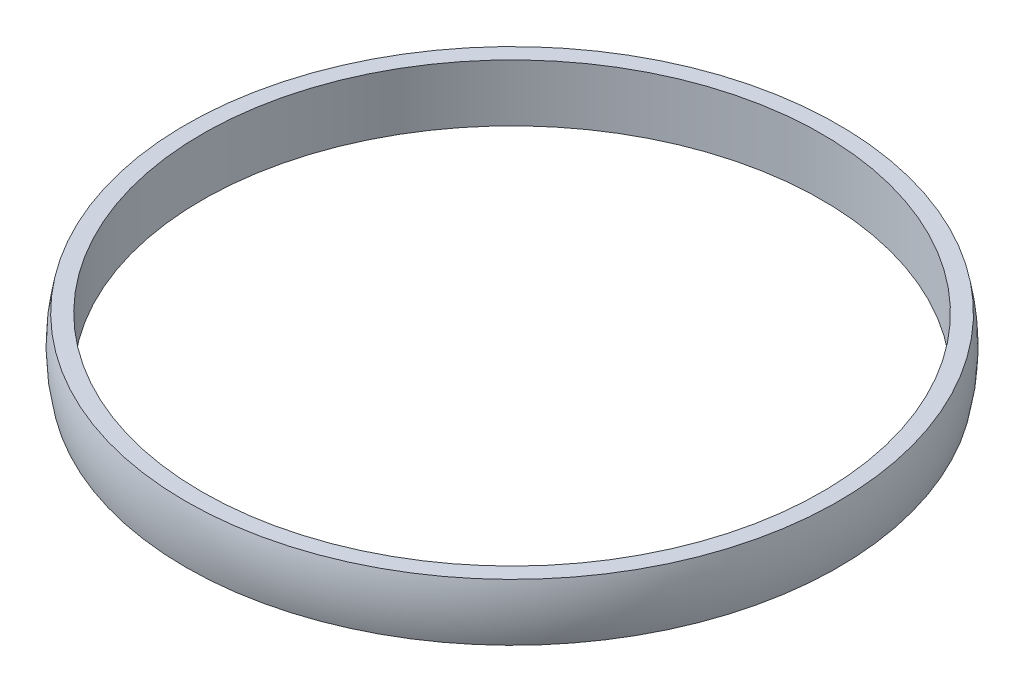
ISO-10303-21;
HEADER;
FILE_DESCRIPTION(('STEP AP214'),'2;1');
FILE_NAME('part.step','',(''),(''),'','','');
FILE_SCHEMA(('AUTOMOTIVE_DESIGN { 1 0 10303 214 1 1 1 1 }'));
ENDSEC;
DATA;
#1=APPLICATION_CONTEXT('core data for automotive mechanical design processes');
#2=APPLICATION_PROTOCOL_DEFINITION('international standard','automotive_design',2000,#1);
#3=PRODUCT_CONTEXT('',#1,'mechanical');
#4=PRODUCT('Part','Part','',(#3));
#5=PRODUCT_RELATED_PRODUCT_CATEGORY('part','',(#4));
#6=PRODUCT_DEFINITION_FORMATION('','',#4);
#7=PRODUCT_DEFINITION_CONTEXT('part definition',#1,'design');
#8=PRODUCT_DEFINITION('design','',#6,#7);
#9=PRODUCT_DEFINITION_SHAPE('','',#8);
#10=(LENGTH_UNIT() NAMED_UNIT(*) SI_UNIT(.MILLI.,.METRE.));
#11=(NAMED_UNIT(*) PLANE_ANGLE_UNIT() SI_UNIT($,.RADIAN.));
#12=(NAMED_UNIT(*) SI_UNIT($,.STERADIAN.) SOLID_ANGLE_UNIT());
#13=UNCERTAINTY_MEASURE_WITH_UNIT(LENGTH_MEASURE(1.E-05),#10,'distance_accuracy_value','');
#14=(GEOMETRIC_REPRESENTATION_CONTEXT(3) GLOBAL_UNCERTAINTY_ASSIGNED_CONTEXT((#13)) GLOBAL_UNIT_ASSIGNED_CONTEXT((#10,
#11,#12)) REPRESENTATION_CONTEXT('',''));
#15=CARTESIAN_POINT('',(0.,0.,0.));
#16=DIRECTION('',(0.,0.,1.));
#17=DIRECTION('',(1.,0.,0.));
#18=AXIS2_PLACEMENT_3D('',#15,#16,#17);
#19=CARTESIAN_POINT('',(0.,2.68129158133309,0.));
#20=DIRECTION('',(0.,1.,0.));
#21=DIRECTION('',(0.,0.,1.));
#22=AXIS2_PLACEMENT_3D('',#19,#20,#21);
#23=CYLINDRICAL_SURFACE('',#22,38.);
#24=CARTESIAN_POINT('',(0.,-3.5,0.));
#25=DIRECTION('',(0.,1.,0.));
#26=DIRECTION('',(0.,0.,1.));
#27=AXIS2_PLACEMENT_3D('',#24,#25,#26);
#28=CIRCLE('',#27,38.);
#29=CARTESIAN_POINT('',(0.,-3.5,38.));
#30=VERTEX_POINT('',#29);
#31=EDGE_CURVE('E53',#30,#30,#28,.T.);
#32=ORIENTED_EDGE('',*,*,#31,.F.);
#33=EDGE_LOOP('',(#32));
#34=FACE_BOUND('',#33,.T.);
#35=CARTESIAN_POINT('',(0.,3.5,0.));
#36=DIRECTION('',(0.,1.,0.));
#37=DIRECTION('',(0.,0.,1.));
#38=AXIS2_PLACEMENT_3D('',#35,#36,#37);
#39=CIRCLE('',#38,38.);
#40=CARTESIAN_POINT('',(0.,3.5,38.));
#41=VERTEX_POINT('',#40);
#42=EDGE_CURVE('E10',#41,#41,#39,.T.);
#43=ORIENTED_EDGE('',*,*,#42,.T.);
#44=EDGE_LOOP('',(#43));
#45=FACE_BOUND('',#44,.T.);
#46=ADVANCED_FACE('F39',(#34,#45),#23,.F.);
#47=CARTESIAN_POINT('',(38.,3.5,0.));
#48=DIRECTION('',(0.,-1.,0.));
#49=DIRECTION('',(0.,0.,-1.));
#50=AXIS2_PLACEMENT_3D('',#47,#48,#49);
#51=PLANE('',#50);
#52=ORIENTED_EDGE('',*,*,#42,.F.);
#53=EDGE_LOOP('',(#52));
#54=FACE_BOUND('',#53,.T.);
#55=CARTESIAN_POINT('',(0.,3.5,0.));
#56=DIRECTION('',(0.,1.,0.));
#57=DIRECTION('',(0.,0.,1.));
#58=AXIS2_PLACEMENT_3D('',#55,#56,#57);
#59=CIRCLE('',#58,40.);
#60=CARTESIAN_POINT('',(0.,3.5,40.));
#61=VERTEX_POINT('',#60);
#62=EDGE_CURVE('E45',#61,#61,#59,.T.);
#63=ORIENTED_EDGE('',*,*,#62,.T.);
#64=EDGE_LOOP('',(#63));
#65=FACE_BOUND('',#64,.T.);
#66=ADVANCED_FACE('F62',(#54,#65),#51,.F.);
#67=CARTESIAN_POINT('',(0.,0.,0.));
#68=DIRECTION('',(0.,1.,0.));
#69=DIRECTION('',(0.,0.,1.));
#70=AXIS2_PLACEMENT_3D('',#67,#68,#69);
#71=TOROIDAL_SURFACE('',#70,25.,15.4029218007494);
#72=ORIENTED_EDGE('',*,*,#62,.F.);
#73=EDGE_LOOP('',(#72));
#74=FACE_BOUND('',#73,.T.);
#75=CARTESIAN_POINT('',(0.,-3.5,0.));
#76=DIRECTION('',(0.,1.,0.));
#77=DIRECTION('',(0.,0.,1.));
#78=AXIS2_PLACEMENT_3D('',#75,#76,#77);
#79=CIRCLE('',#78,40.);
#80=CARTESIAN_POINT('',(0.,-3.5,40.));
#81=VERTEX_POINT('',#80);
#82=EDGE_CURVE('E49',#81,#81,#79,.T.);
#83=ORIENTED_EDGE('',*,*,#82,.T.);
#84=EDGE_LOOP('',(#83));
#85=FACE_BOUND('',#84,.T.);
#86=ADVANCED_FACE('F66',(#74,#85),#71,.T.);
#87=CARTESIAN_POINT('',(38.,-3.5,0.));
#88=DIRECTION('',(0.,1.,0.));
#89=DIRECTION('',(0.,0.,1.));
#90=AXIS2_PLACEMENT_3D('',#87,#88,#89);
#91=PLANE('',#90);
#92=ORIENTED_EDGE('',*,*,#82,.F.);
#93=EDGE_LOOP('',(#92));
#94=FACE_BOUND('',#93,.T.);
#95=ORIENTED_EDGE('',*,*,#31,.T.);
#96=EDGE_LOOP('',(#95));
#97=FACE_BOUND('',#96,.T.);
#98=ADVANCED_FACE('F59',(#94,#97),#91,.F.);
#99=CLOSED_SHELL('',(#46,#66,#86,#98));
#100=MANIFOLD_SOLID_BREP('B2',#99);
#101=ADVANCED_BREP_SHAPE_REPRESENTATION('',(#18,#100),#14);
#102=SHAPE_DEFINITION_REPRESENTATION(#9,#101);
ENDSEC;
END-ISO-10303-21;
